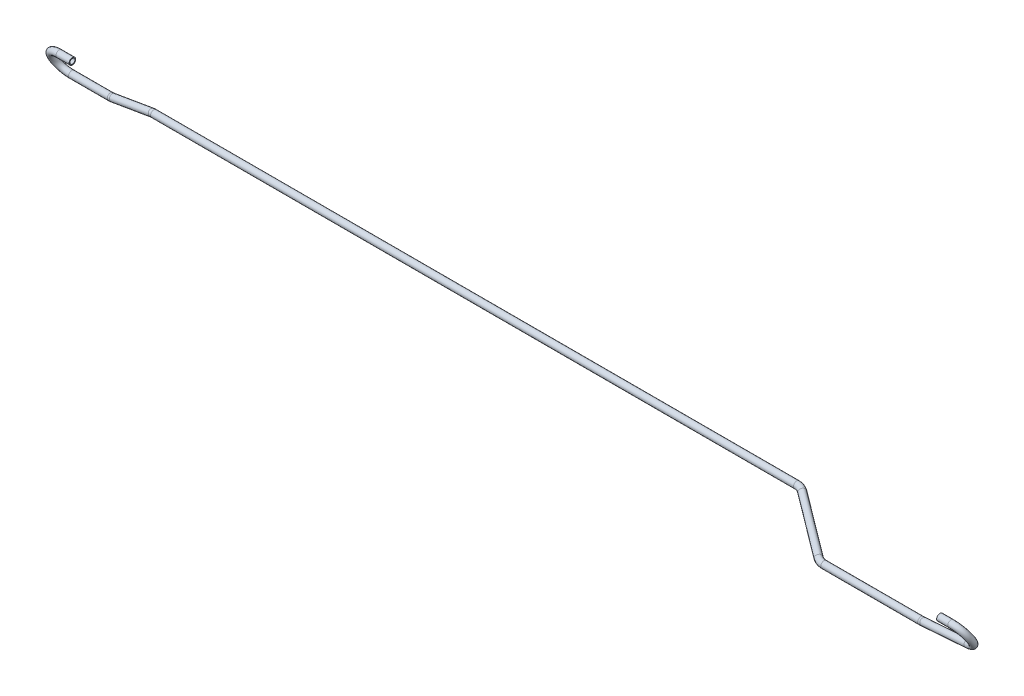
ISO-10303-21;
HEADER;
FILE_DESCRIPTION(('STEP AP214'),'2;1');
FILE_NAME('part.step','',(''),(''),'','','');
FILE_SCHEMA(('AUTOMOTIVE_DESIGN { 1 0 10303 214 1 1 1 1 }'));
ENDSEC;
DATA;
#1=APPLICATION_CONTEXT('core data for automotive mechanical design processes');
#2=APPLICATION_PROTOCOL_DEFINITION('international standard','automotive_design',2000,#1);
#3=PRODUCT_CONTEXT('',#1,'mechanical');
#4=PRODUCT('Part','Part','',(#3));
#5=PRODUCT_RELATED_PRODUCT_CATEGORY('part','',(#4));
#6=PRODUCT_DEFINITION_FORMATION('','',#4);
#7=PRODUCT_DEFINITION_CONTEXT('part definition',#1,'design');
#8=PRODUCT_DEFINITION('design','',#6,#7);
#9=PRODUCT_DEFINITION_SHAPE('','',#8);
#10=(LENGTH_UNIT() NAMED_UNIT(*) SI_UNIT(.MILLI.,.METRE.));
#11=(NAMED_UNIT(*) PLANE_ANGLE_UNIT() SI_UNIT($,.RADIAN.));
#12=(NAMED_UNIT(*) SI_UNIT($,.STERADIAN.) SOLID_ANGLE_UNIT());
#13=UNCERTAINTY_MEASURE_WITH_UNIT(LENGTH_MEASURE(1.E-05),#10,'distance_accuracy_value','');
#14=(GEOMETRIC_REPRESENTATION_CONTEXT(3) GLOBAL_UNCERTAINTY_ASSIGNED_CONTEXT((#13)) GLOBAL_UNIT_ASSIGNED_CONTEXT((#10,
#11,#12)) REPRESENTATION_CONTEXT('',''));
#15=CARTESIAN_POINT('',(0.,0.,0.));
#16=DIRECTION('',(0.,0.,1.));
#17=DIRECTION('',(1.,0.,0.));
#18=AXIS2_PLACEMENT_3D('',#15,#16,#17);
#19=CARTESIAN_POINT('',(-2265.95686527294,-5.47009311471611,-121.5));
#20=DIRECTION('',(1.,0.,0.));
#21=DIRECTION('',(0.,0.,-1.));
#22=AXIS2_PLACEMENT_3D('',#19,#20,#21);
#23=CYLINDRICAL_SURFACE('',#22,8.);
#24=CARTESIAN_POINT('',(-2265.95686527294,-5.47009311471611,-121.5));
#25=DIRECTION('',(1.,0.,0.));
#26=DIRECTION('',(0.,-0.134864319641133,-0.990864075081812));
#27=AXIS2_PLACEMENT_3D('',#24,#25,#26);
#28=CIRCLE('',#27,8.);
#29=CARTESIAN_POINT('',(-2265.95686527294,1.6244410531971,-117.80303030303));
#30=VERTEX_POINT('',#29);
#31=EDGE_CURVE('E47',#30,#30,#28,.T.);
#32=ORIENTED_EDGE('',*,*,#31,.T.);
#33=EDGE_LOOP('',(#32));
#34=FACE_BOUND('',#33,.T.);
#35=CARTESIAN_POINT('',(-2233.95686527294,-5.47009311471611,-121.5));
#36=DIRECTION('',(1.,0.,0.));
#37=DIRECTION('',(0.,-0.134864319641133,-0.990864075081812));
#38=AXIS2_PLACEMENT_3D('',#35,#36,#37);
#39=CIRCLE('',#38,8.);
#40=CARTESIAN_POINT('',(-2233.95686527294,-6.54900767184517,-129.426912600654));
#41=VERTEX_POINT('',#40);
#42=EDGE_CURVE('E10',#41,#41,#39,.T.);
#43=ORIENTED_EDGE('',*,*,#42,.F.);
#44=EDGE_LOOP('',(#43));
#45=FACE_BOUND('',#44,.T.);
#46=ADVANCED_FACE('F37',(#34,#45),#23,.T.);
#47=CARTESIAN_POINT('',(-2265.95686527294,-5.47009311471611,-121.5));
#48=DIRECTION('',(1.,0.,0.));
#49=DIRECTION('',(0.,0.,-1.));
#50=AXIS2_PLACEMENT_3D('',#47,#48,#49);
#51=CYLINDRICAL_SURFACE('',#50,6.);
#52=CARTESIAN_POINT('',(-2265.95686527294,-5.47009311471611,-121.5));
#53=DIRECTION('',(1.,0.,0.));
#54=DIRECTION('',(0.,-0.134864319641133,-0.990864075081812));
#55=AXIS2_PLACEMENT_3D('',#52,#53,#54);
#56=CIRCLE('',#55,6.);
#57=CARTESIAN_POINT('',(-2265.95686527294,-0.149192488781202,-118.727272727273));
#58=VERTEX_POINT('',#57);
#59=EDGE_CURVE('E51',#58,#58,#56,.T.);
#60=ORIENTED_EDGE('',*,*,#59,.F.);
#61=EDGE_LOOP('',(#60));
#62=FACE_BOUND('',#61,.T.);
#63=CARTESIAN_POINT('',(-2233.95686527294,-5.47009311471611,-121.5));
#64=DIRECTION('',(1.,0.,0.));
#65=DIRECTION('',(0.,-0.134864319641133,-0.990864075081812));
#66=AXIS2_PLACEMENT_3D('',#63,#64,#65);
#67=CIRCLE('',#66,6.);
#68=CARTESIAN_POINT('',(-2233.95686527294,-6.27927903256291,-127.445184450491));
#69=VERTEX_POINT('',#68);
#70=EDGE_CURVE('E43',#69,#69,#67,.T.);
#71=ORIENTED_EDGE('',*,*,#70,.T.);
#72=EDGE_LOOP('',(#71));
#73=FACE_BOUND('',#72,.T.);
#74=ADVANCED_FACE('F235',(#62,#73),#51,.F.);
#75=CARTESIAN_POINT('',(-2265.95686527294,-34.7350465573581,-136.75));
#76=DIRECTION('',(0.,0.462121212121212,-0.88681677098915));
#77=DIRECTION('',(0.,0.88681677098915,0.462121212121212));
#78=AXIS2_PLACEMENT_3D('',#75,#76,#77);
#79=TOROIDAL_SURFACE('',#78,33.0000000000001,8.);
#80=CARTESIAN_POINT('',(-2265.95686527294,-64.0000000000001,-152.));
#81=DIRECTION('',(-1.,0.,0.));
#82=DIRECTION('',(0.,0.889407716883756,-0.457114770213811));
#83=AXIS2_PLACEMENT_3D('',#80,#81,#82);
#84=CIRCLE('',#83,8.);
#85=CARTESIAN_POINT('',(-2265.95686527294,-71.0945341679133,-155.69696969697));
#86=VERTEX_POINT('',#85);
#87=EDGE_CURVE('E56',#86,#86,#84,.T.);
#88=CARTESIAN_POINT('',(-2265.95686527294,-34.7350465573581,-136.75));
#89=DIRECTION('',(0.,0.462121212121212,-0.88681677098915));
#90=DIRECTION('',(0.,0.88681677098915,0.462121212121212));
#91=AXIS2_PLACEMENT_3D('',#88,#89,#90);
#92=CIRCLE('',#91,41.0000000000001);
#93=EDGE_CURVE('',#86,#30,#92,.T.);
#94=ORIENTED_EDGE('',*,*,#87,.T.);
#95=ORIENTED_EDGE('',*,*,#31,.F.);
#96=ORIENTED_EDGE('',*,*,#93,.T.);
#97=ORIENTED_EDGE('',*,*,#93,.F.);
#98=EDGE_LOOP('',(#94,#96,#95,#97));
#99=FACE_BOUND('',#98,.T.);
#100=ADVANCED_FACE('F231',(#99),#79,.T.);
#101=CARTESIAN_POINT('',(-2265.95686527294,-34.7350465573581,-136.75));
#102=DIRECTION('',(0.,0.462121212121212,-0.88681677098915));
#103=DIRECTION('',(0.,0.88681677098915,0.462121212121212));
#104=AXIS2_PLACEMENT_3D('',#101,#102,#103);
#105=TOROIDAL_SURFACE('',#104,33.0000000000001,6.);
#106=CARTESIAN_POINT('',(-2265.95686527294,-64.0000000000001,-152.));
#107=DIRECTION('',(-1.,0.,0.));
#108=DIRECTION('',(0.,0.889407716883756,-0.457114770213811));
#109=AXIS2_PLACEMENT_3D('',#106,#107,#108);
#110=CIRCLE('',#109,6.);
#111=CARTESIAN_POINT('',(-2265.95686527294,-69.320900625935,-154.772727272727));
#112=VERTEX_POINT('',#111);
#113=EDGE_CURVE('E59',#112,#112,#110,.T.);
#114=CARTESIAN_POINT('',(-2265.95686527294,-34.7350465573581,-136.75));
#115=DIRECTION('',(0.,0.462121212121212,-0.88681677098915));
#116=DIRECTION('',(0.,0.88681677098915,0.462121212121212));
#117=AXIS2_PLACEMENT_3D('',#114,#115,#116);
#118=CIRCLE('',#117,39.0000000000001);
#119=EDGE_CURVE('',#112,#58,#118,.T.);
#120=ORIENTED_EDGE('',*,*,#113,.F.);
#121=ORIENTED_EDGE('',*,*,#59,.T.);
#122=ORIENTED_EDGE('',*,*,#119,.T.);
#123=ORIENTED_EDGE('',*,*,#119,.F.);
#124=EDGE_LOOP('',(#120,#122,#121,#123));
#125=FACE_BOUND('',#124,.T.);
#126=ADVANCED_FACE('F228',(#125),#105,.F.);
#127=CARTESIAN_POINT('',(-2171.74188680867,-64.0000000000002,-152.));
#128=DIRECTION('',(-1.,0.,0.));
#129=DIRECTION('',(0.,-1.,0.));
#130=AXIS2_PLACEMENT_3D('',#127,#128,#129);
#131=CYLINDRICAL_SURFACE('',#130,8.);
#132=CARTESIAN_POINT('',(-2171.74188680867,-64.0000000000002,-152.));
#133=DIRECTION('',(-1.,0.,0.));
#134=DIRECTION('',(0.,0.889407716883756,-0.457114770213811));
#135=AXIS2_PLACEMENT_3D('',#132,#133,#134);
#136=CIRCLE('',#135,8.);
#137=CARTESIAN_POINT('',(-2171.74188680867,-72.0000000000001,-152.));
#138=VERTEX_POINT('',#137);
#139=EDGE_CURVE('E62',#138,#138,#136,.T.);
#140=ORIENTED_EDGE('',*,*,#139,.T.);
#141=EDGE_LOOP('',(#140));
#142=FACE_BOUND('',#141,.T.);
#143=ORIENTED_EDGE('',*,*,#87,.F.);
#144=EDGE_LOOP('',(#143));
#145=FACE_BOUND('',#144,.T.);
#146=ADVANCED_FACE('F224',(#142,#145),#131,.T.);
#147=CARTESIAN_POINT('',(-2171.74188680867,-64.0000000000002,-152.));
#148=DIRECTION('',(-1.,0.,0.));
#149=DIRECTION('',(0.,-1.,0.));
#150=AXIS2_PLACEMENT_3D('',#147,#148,#149);
#151=CYLINDRICAL_SURFACE('',#150,6.);
#152=CARTESIAN_POINT('',(-2171.74188680867,-64.0000000000002,-152.));
#153=DIRECTION('',(-1.,0.,0.));
#154=DIRECTION('',(0.,0.889407716883756,-0.457114770213811));
#155=AXIS2_PLACEMENT_3D('',#152,#153,#154);
#156=CIRCLE('',#155,6.);
#157=CARTESIAN_POINT('',(-2171.74188680867,-70.0000000000001,-152.));
#158=VERTEX_POINT('',#157);
#159=EDGE_CURVE('E65',#158,#158,#156,.T.);
#160=ORIENTED_EDGE('',*,*,#159,.F.);
#161=EDGE_LOOP('',(#160));
#162=FACE_BOUND('',#161,.T.);
#163=ORIENTED_EDGE('',*,*,#113,.T.);
#164=EDGE_LOOP('',(#163));
#165=FACE_BOUND('',#164,.T.);
#166=ADVANCED_FACE('F221',(#162,#165),#151,.F.);
#167=CARTESIAN_POINT('',(-2171.74188680867,-31.,-152.));
#168=DIRECTION('',(0.,0.,-1.));
#169=DIRECTION('',(0.,1.,0.));
#170=AXIS2_PLACEMENT_3D('',#167,#168,#169);
#171=TOROIDAL_SURFACE('',#170,33.0000000000001,8.);
#172=CARTESIAN_POINT('',(-2166.21123550885,-63.533242940104,-152.));
#173=DIRECTION('',(-0.985855846669819,-0.167595493933862,0.));
#174=DIRECTION('',(-0.149060725619722,0.876827797763105,-0.457114770213811));
#175=AXIS2_PLACEMENT_3D('',#172,#173,#174);
#176=CIRCLE('',#175,8.);
#177=CARTESIAN_POINT('',(-2164.87047155738,-71.4200897134626,-152.));
#178=VERTEX_POINT('',#177);
#179=EDGE_CURVE('E68',#178,#178,#176,.T.);
#180=CARTESIAN_POINT('',(-2171.74188680867,-31.,-152.));
#181=DIRECTION('',(0.,0.,-1.));
#182=DIRECTION('',(0.,1.,0.));
#183=AXIS2_PLACEMENT_3D('',#180,#181,#182);
#184=CIRCLE('',#183,41.0000000000001);
#185=EDGE_CURVE('',#178,#138,#184,.T.);
#186=ORIENTED_EDGE('',*,*,#179,.T.);
#187=ORIENTED_EDGE('',*,*,#139,.F.);
#188=ORIENTED_EDGE('',*,*,#185,.T.);
#189=ORIENTED_EDGE('',*,*,#185,.F.);
#190=EDGE_LOOP('',(#186,#188,#187,#189));
#191=FACE_BOUND('',#190,.T.);
#192=ADVANCED_FACE('F217',(#191),#171,.T.);
#193=CARTESIAN_POINT('',(-2171.74188680867,-31.,-152.));
#194=DIRECTION('',(0.,0.,-1.));
#195=DIRECTION('',(0.,1.,0.));
#196=AXIS2_PLACEMENT_3D('',#193,#194,#195);
#197=TOROIDAL_SURFACE('',#196,33.0000000000001,6.);
#198=CARTESIAN_POINT('',(-2166.21123550885,-63.533242940104,-152.));
#199=DIRECTION('',(-0.985855846669819,-0.167595493933862,0.));
#200=DIRECTION('',(-0.149060725619722,0.876827797763105,-0.457114770213811));
#201=AXIS2_PLACEMENT_3D('',#198,#199,#200);
#202=CIRCLE('',#201,6.);
#203=CARTESIAN_POINT('',(-2165.20566254525,-69.4483780201229,-152.));
#204=VERTEX_POINT('',#203);
#205=EDGE_CURVE('E71',#204,#204,#202,.T.);
#206=CARTESIAN_POINT('',(-2171.74188680867,-31.,-152.));
#207=DIRECTION('',(0.,0.,-1.));
#208=DIRECTION('',(0.,1.,0.));
#209=AXIS2_PLACEMENT_3D('',#206,#207,#208);
#210=CIRCLE('',#209,39.0000000000001);
#211=EDGE_CURVE('',#204,#158,#210,.T.);
#212=ORIENTED_EDGE('',*,*,#205,.F.);
#213=ORIENTED_EDGE('',*,*,#159,.T.);
#214=ORIENTED_EDGE('',*,*,#211,.T.);
#215=ORIENTED_EDGE('',*,*,#211,.F.);
#216=EDGE_LOOP('',(#212,#214,#213,#215));
#217=FACE_BOUND('',#216,.T.);
#218=ADVANCED_FACE('F214',(#217),#197,.F.);
#219=CARTESIAN_POINT('',(-2071.70249503704,-47.4667570598961,-152.));
#220=DIRECTION('',(-0.985855846669818,-0.167595493933869,0.));
#221=DIRECTION('',(0.167595493933869,-0.985855846669817,0.));
#222=AXIS2_PLACEMENT_3D('',#219,#220,#221);
#223=CYLINDRICAL_SURFACE('',#222,8.);
#224=CARTESIAN_POINT('',(-2071.70249503704,-47.4667570598961,-152.));
#225=DIRECTION('',(-0.985855846669819,-0.167595493933862,0.));
#226=DIRECTION('',(-0.149060725619722,0.876827797763105,-0.457114770213811));
#227=AXIS2_PLACEMENT_3D('',#224,#225,#226);
#228=CIRCLE('',#227,8.);
#229=CARTESIAN_POINT('',(-2073.04325898851,-39.5799102865375,-152.));
#230=VERTEX_POINT('',#229);
#231=EDGE_CURVE('E74',#230,#230,#228,.T.);
#232=ORIENTED_EDGE('',*,*,#231,.T.);
#233=EDGE_LOOP('',(#232));
#234=FACE_BOUND('',#233,.T.);
#235=ORIENTED_EDGE('',*,*,#179,.F.);
#236=EDGE_LOOP('',(#235));
#237=FACE_BOUND('',#236,.T.);
#238=ADVANCED_FACE('F210',(#234,#237),#223,.T.);
#239=CARTESIAN_POINT('',(-2071.70249503704,-47.4667570598961,-152.));
#240=DIRECTION('',(-0.985855846669818,-0.167595493933869,0.));
#241=DIRECTION('',(0.167595493933869,-0.985855846669817,0.));
#242=AXIS2_PLACEMENT_3D('',#239,#240,#241);
#243=CYLINDRICAL_SURFACE('',#242,6.);
#244=CARTESIAN_POINT('',(-2071.70249503704,-47.4667570598961,-152.));
#245=DIRECTION('',(-0.985855846669819,-0.167595493933862,0.));
#246=DIRECTION('',(-0.149060725619722,0.876827797763105,-0.457114770213811));
#247=AXIS2_PLACEMENT_3D('',#244,#245,#246);
#248=CIRCLE('',#247,6.);
#249=CARTESIAN_POINT('',(-2072.70806800064,-41.5516219798771,-152.));
#250=VERTEX_POINT('',#249);
#251=EDGE_CURVE('E77',#250,#250,#248,.T.);
#252=ORIENTED_EDGE('',*,*,#251,.F.);
#253=EDGE_LOOP('',(#252));
#254=FACE_BOUND('',#253,.T.);
#255=ORIENTED_EDGE('',*,*,#205,.T.);
#256=EDGE_LOOP('',(#255));
#257=FACE_BOUND('',#256,.T.);
#258=ADVANCED_FACE('F207',(#254,#257),#243,.F.);
#259=CARTESIAN_POINT('',(-2066.17184373722,-80.,-152.));
#260=DIRECTION('',(0.,0.,1.));
#261=DIRECTION('',(0.,-1.,0.));
#262=AXIS2_PLACEMENT_3D('',#259,#260,#261);
#263=TOROIDAL_SURFACE('',#262,33.,8.);
#264=CARTESIAN_POINT('',(-2066.17184373722,-47.,-152.));
#265=DIRECTION('',(-1.,0.,0.));
#266=DIRECTION('',(0.,0.889407716883756,-0.457114770213811));
#267=AXIS2_PLACEMENT_3D('',#264,#265,#266);
#268=CIRCLE('',#267,8.);
#269=CARTESIAN_POINT('',(-2066.17184373722,-39.,-152.));
#270=VERTEX_POINT('',#269);
#271=EDGE_CURVE('E80',#270,#270,#268,.T.);
#272=CARTESIAN_POINT('',(-2066.17184373722,-80.,-152.));
#273=DIRECTION('',(0.,0.,1.));
#274=DIRECTION('',(0.,-1.,0.));
#275=AXIS2_PLACEMENT_3D('',#272,#273,#274);
#276=CIRCLE('',#275,41.);
#277=EDGE_CURVE('',#270,#230,#276,.T.);
#278=ORIENTED_EDGE('',*,*,#271,.T.);
#279=ORIENTED_EDGE('',*,*,#231,.F.);
#280=ORIENTED_EDGE('',*,*,#277,.T.);
#281=ORIENTED_EDGE('',*,*,#277,.F.);
#282=EDGE_LOOP('',(#278,#280,#279,#281));
#283=FACE_BOUND('',#282,.T.);
#284=ADVANCED_FACE('F203',(#283),#263,.T.);
#285=CARTESIAN_POINT('',(-2066.17184373722,-80.,-152.));
#286=DIRECTION('',(0.,0.,1.));
#287=DIRECTION('',(0.,-1.,0.));
#288=AXIS2_PLACEMENT_3D('',#285,#286,#287);
#289=TOROIDAL_SURFACE('',#288,33.,6.);
#290=CARTESIAN_POINT('',(-2066.17184373722,-47.,-152.));
#291=DIRECTION('',(-1.,0.,0.));
#292=DIRECTION('',(0.,0.889407716883756,-0.457114770213811));
#293=AXIS2_PLACEMENT_3D('',#290,#291,#292);
#294=CIRCLE('',#293,6.);
#295=CARTESIAN_POINT('',(-2066.17184373722,-41.,-152.));
#296=VERTEX_POINT('',#295);
#297=EDGE_CURVE('E83',#296,#296,#294,.T.);
#298=CARTESIAN_POINT('',(-2066.17184373722,-80.,-152.));
#299=DIRECTION('',(0.,0.,1.));
#300=DIRECTION('',(0.,-1.,0.));
#301=AXIS2_PLACEMENT_3D('',#298,#299,#300);
#302=CIRCLE('',#301,39.);
#303=EDGE_CURVE('',#296,#250,#302,.T.);
#304=ORIENTED_EDGE('',*,*,#297,.F.);
#305=ORIENTED_EDGE('',*,*,#251,.T.);
#306=ORIENTED_EDGE('',*,*,#303,.T.);
#307=ORIENTED_EDGE('',*,*,#303,.F.);
#308=EDGE_LOOP('',(#304,#306,#305,#307));
#309=FACE_BOUND('',#308,.T.);
#310=ADVANCED_FACE('F200',(#309),#289,.F.);
#311=CARTESIAN_POINT('',(-500.739873178463,-47.,-152.));
#312=DIRECTION('',(-1.,0.,0.));
#313=DIRECTION('',(0.,0.,1.));
#314=AXIS2_PLACEMENT_3D('',#311,#312,#313);
#315=CYLINDRICAL_SURFACE('',#314,8.);
#316=CARTESIAN_POINT('',(-500.739873178463,-47.,-152.));
#317=DIRECTION('',(-1.,0.,0.));
#318=DIRECTION('',(0.,0.889407716883756,-0.457114770213811));
#319=AXIS2_PLACEMENT_3D('',#316,#317,#318);
#320=CIRCLE('',#319,8.);
#321=CARTESIAN_POINT('',(-500.739873178463,-44.802230976821,-159.692191581126));
#322=VERTEX_POINT('',#321);
#323=EDGE_CURVE('E86',#322,#322,#320,.T.);
#324=ORIENTED_EDGE('',*,*,#323,.T.);
#325=EDGE_LOOP('',(#324));
#326=FACE_BOUND('',#325,.T.);
#327=ORIENTED_EDGE('',*,*,#271,.F.);
#328=EDGE_LOOP('',(#327));
#329=FACE_BOUND('',#328,.T.);
#330=ADVANCED_FACE('F196',(#326,#329),#315,.T.);
#331=CARTESIAN_POINT('',(-500.739873178463,-47.,-152.));
#332=DIRECTION('',(-1.,0.,0.));
#333=DIRECTION('',(0.,0.,1.));
#334=AXIS2_PLACEMENT_3D('',#331,#332,#333);
#335=CYLINDRICAL_SURFACE('',#334,6.);
#336=CARTESIAN_POINT('',(-500.739873178463,-47.,-152.));
#337=DIRECTION('',(-1.,0.,0.));
#338=DIRECTION('',(0.,0.889407716883756,-0.457114770213811));
#339=AXIS2_PLACEMENT_3D('',#336,#337,#338);
#340=CIRCLE('',#339,6.);
#341=CARTESIAN_POINT('',(-500.739873178463,-45.3516732326158,-157.769143685845));
#342=VERTEX_POINT('',#341);
#343=EDGE_CURVE('E89',#342,#342,#340,.T.);
#344=ORIENTED_EDGE('',*,*,#343,.F.);
#345=EDGE_LOOP('',(#344));
#346=FACE_BOUND('',#345,.T.);
#347=ORIENTED_EDGE('',*,*,#297,.T.);
#348=EDGE_LOOP('',(#347));
#349=FACE_BOUND('',#348,.T.);
#350=ADVANCED_FACE('F193',(#346,#349),#335,.F.);
#351=CARTESIAN_POINT('',(-500.739873178463,-56.0657972206135,-120.269709727853));
#352=DIRECTION('',(0.,0.961523947640823,0.274721127897378));
#353=DIRECTION('',(0.,-0.274721127897378,0.961523947640823));
#354=AXIS2_PLACEMENT_3D('',#351,#352,#353);
#355=TOROIDAL_SURFACE('',#354,32.9999999999999,8.);
#356=CARTESIAN_POINT('',(-481.317327152835,-48.7365345694331,-145.922129006984));
#357=DIRECTION('',(-0.808452083454443,0.161690416690889,-0.565916458418111));
#358=DIRECTION('',(0.402497476201035,0.853421148459082,-0.331161780727455));
#359=AXIS2_PLACEMENT_3D('',#356,#357,#358);
#360=CIRCLE('',#359,8.);
#361=CARTESIAN_POINT('',(-476.608831146622,-46.9597436236923,-152.140897317077));
#362=VERTEX_POINT('',#361);
#363=EDGE_CURVE('E92',#362,#362,#360,.T.);
#364=CARTESIAN_POINT('',(-500.739873178463,-56.0657972206135,-120.269709727853));
#365=DIRECTION('',(0.,0.961523947640823,0.274721127897378));
#366=DIRECTION('',(0.,-0.274721127897378,0.961523947640823));
#367=AXIS2_PLACEMENT_3D('',#364,#365,#366);
#368=CIRCLE('',#367,40.9999999999999);
#369=EDGE_CURVE('',#362,#322,#368,.T.);
#370=ORIENTED_EDGE('',*,*,#363,.T.);
#371=ORIENTED_EDGE('',*,*,#323,.F.);
#372=ORIENTED_EDGE('',*,*,#369,.T.);
#373=ORIENTED_EDGE('',*,*,#369,.F.);
#374=EDGE_LOOP('',(#370,#372,#371,#373));
#375=FACE_BOUND('',#374,.T.);
#376=ADVANCED_FACE('F189',(#375),#355,.T.);
#377=CARTESIAN_POINT('',(-500.739873178463,-56.0657972206135,-120.269709727853));
#378=DIRECTION('',(0.,0.961523947640823,0.274721127897378));
#379=DIRECTION('',(0.,-0.274721127897378,0.961523947640823));
#380=AXIS2_PLACEMENT_3D('',#377,#378,#379);
#381=TOROIDAL_SURFACE('',#380,32.9999999999999,6.);
#382=CARTESIAN_POINT('',(-481.317327152835,-48.7365345694331,-145.922129006984));
#383=DIRECTION('',(-0.808452083454443,0.161690416690889,-0.565916458418111));
#384=DIRECTION('',(0.402497476201035,0.853421148459082,-0.331161780727455));
#385=AXIS2_PLACEMENT_3D('',#382,#383,#384);
#386=CIRCLE('',#385,6.);
#387=CARTESIAN_POINT('',(-477.785955148175,-47.4039413601275,-150.586205239554));
#388=VERTEX_POINT('',#387);
#389=EDGE_CURVE('E95',#388,#388,#386,.T.);
#390=CARTESIAN_POINT('',(-500.739873178463,-56.0657972206135,-120.269709727853));
#391=DIRECTION('',(0.,0.961523947640823,0.274721127897378));
#392=DIRECTION('',(0.,-0.274721127897378,0.961523947640823));
#393=AXIS2_PLACEMENT_3D('',#390,#391,#392);
#394=CIRCLE('',#393,38.9999999999999);
#395=EDGE_CURVE('',#388,#342,#394,.T.);
#396=ORIENTED_EDGE('',*,*,#389,.F.);
#397=ORIENTED_EDGE('',*,*,#343,.T.);
#398=ORIENTED_EDGE('',*,*,#395,.T.);
#399=ORIENTED_EDGE('',*,*,#395,.F.);
#400=EDGE_LOOP('',(#396,#398,#397,#399));
#401=FACE_BOUND('',#400,.T.);
#402=ADVANCED_FACE('F186',(#401),#381,.F.);
#403=CARTESIAN_POINT('',(-348.682672847165,-75.263465430567,-53.0778709930156));
#404=DIRECTION('',(-0.808452083454443,0.161690416690889,-0.56591645841811));
#405=DIRECTION('',(-0.573462344363328,0.,0.819231920519041));
#406=AXIS2_PLACEMENT_3D('',#403,#404,#405);
#407=CYLINDRICAL_SURFACE('',#406,8.);
#408=CARTESIAN_POINT('',(-348.682672847165,-75.263465430567,-53.0778709930156));
#409=DIRECTION('',(-0.808452083454443,0.161690416690889,-0.565916458418111));
#410=DIRECTION('',(0.402497476201035,0.853421148459082,-0.331161780727455));
#411=AXIS2_PLACEMENT_3D('',#408,#409,#410);
#412=CIRCLE('',#411,8.);
#413=CARTESIAN_POINT('',(-353.391168853378,-77.0402563763078,-46.8591026829231));
#414=VERTEX_POINT('',#413);
#415=EDGE_CURVE('E98',#414,#414,#412,.T.);
#416=ORIENTED_EDGE('',*,*,#415,.T.);
#417=EDGE_LOOP('',(#416));
#418=FACE_BOUND('',#417,.T.);
#419=ORIENTED_EDGE('',*,*,#363,.F.);
#420=EDGE_LOOP('',(#419));
#421=FACE_BOUND('',#420,.T.);
#422=ADVANCED_FACE('F182',(#418,#421),#407,.T.);
#423=CARTESIAN_POINT('',(-348.682672847165,-75.263465430567,-53.0778709930156));
#424=DIRECTION('',(-0.808452083454443,0.161690416690889,-0.56591645841811));
#425=DIRECTION('',(-0.573462344363328,0.,0.819231920519041));
#426=AXIS2_PLACEMENT_3D('',#423,#424,#425);
#427=CYLINDRICAL_SURFACE('',#426,6.);
#428=CARTESIAN_POINT('',(-348.682672847165,-75.263465430567,-53.0778709930156));
#429=DIRECTION('',(-0.808452083454443,0.161690416690889,-0.565916458418111));
#430=DIRECTION('',(0.402497476201035,0.853421148459082,-0.331161780727455));
#431=AXIS2_PLACEMENT_3D('',#428,#429,#430);
#432=CIRCLE('',#431,6.);
#433=CARTESIAN_POINT('',(-352.214044851825,-76.5960586398726,-48.4137947604462));
#434=VERTEX_POINT('',#433);
#435=EDGE_CURVE('E101',#434,#434,#432,.T.);
#436=ORIENTED_EDGE('',*,*,#435,.F.);
#437=EDGE_LOOP('',(#436));
#438=FACE_BOUND('',#437,.T.);
#439=ORIENTED_EDGE('',*,*,#389,.T.);
#440=EDGE_LOOP('',(#439));
#441=FACE_BOUND('',#440,.T.);
#442=ADVANCED_FACE('F179',(#438,#441),#427,.F.);
#443=CARTESIAN_POINT('',(-329.260126821537,-67.9342027793866,-78.7302902721472));
#444=DIRECTION('',(0.,-0.961523947640823,-0.274721127897378));
#445=DIRECTION('',(0.,0.274721127897378,-0.961523947640823));
#446=AXIS2_PLACEMENT_3D('',#443,#444,#445);
#447=TOROIDAL_SURFACE('',#446,33.,8.);
#448=CARTESIAN_POINT('',(-329.260126821537,-77.,-47.));
#449=DIRECTION('',(-1.,0.,0.));
#450=DIRECTION('',(0.,0.889407716883756,-0.457114770213811));
#451=AXIS2_PLACEMENT_3D('',#448,#449,#450);
#452=CIRCLE('',#451,8.);
#453=CARTESIAN_POINT('',(-329.260126821537,-79.1977690231791,-39.3078084188734));
#454=VERTEX_POINT('',#453);
#455=EDGE_CURVE('E104',#454,#454,#452,.T.);
#456=CARTESIAN_POINT('',(-329.260126821537,-67.9342027793866,-78.7302902721472));
#457=DIRECTION('',(0.,-0.961523947640823,-0.274721127897378));
#458=DIRECTION('',(0.,0.274721127897378,-0.961523947640823));
#459=AXIS2_PLACEMENT_3D('',#456,#457,#458);
#460=CIRCLE('',#459,41.);
#461=EDGE_CURVE('',#454,#414,#460,.T.);
#462=ORIENTED_EDGE('',*,*,#455,.T.);
#463=ORIENTED_EDGE('',*,*,#415,.F.);
#464=ORIENTED_EDGE('',*,*,#461,.T.);
#465=ORIENTED_EDGE('',*,*,#461,.F.);
#466=EDGE_LOOP('',(#462,#464,#463,#465));
#467=FACE_BOUND('',#466,.T.);
#468=ADVANCED_FACE('F175',(#467),#447,.T.);
#469=CARTESIAN_POINT('',(-329.260126821537,-67.9342027793866,-78.7302902721472));
#470=DIRECTION('',(0.,-0.961523947640823,-0.274721127897378));
#471=DIRECTION('',(0.,0.274721127897378,-0.961523947640823));
#472=AXIS2_PLACEMENT_3D('',#469,#470,#471);
#473=TOROIDAL_SURFACE('',#472,33.,6.);
#474=CARTESIAN_POINT('',(-329.260126821537,-77.,-47.));
#475=DIRECTION('',(-1.,0.,0.));
#476=DIRECTION('',(0.,0.889407716883756,-0.457114770213811));
#477=AXIS2_PLACEMENT_3D('',#474,#475,#476);
#478=CIRCLE('',#477,6.);
#479=CARTESIAN_POINT('',(-329.260126821537,-78.6483267673843,-41.230856314155));
#480=VERTEX_POINT('',#479);
#481=EDGE_CURVE('E107',#480,#480,#478,.T.);
#482=CARTESIAN_POINT('',(-329.260126821537,-67.9342027793866,-78.7302902721472));
#483=DIRECTION('',(0.,-0.961523947640823,-0.274721127897378));
#484=DIRECTION('',(0.,0.274721127897378,-0.961523947640823));
#485=AXIS2_PLACEMENT_3D('',#482,#483,#484);
#486=CIRCLE('',#485,39.);
#487=EDGE_CURVE('',#480,#434,#486,.T.);
#488=ORIENTED_EDGE('',*,*,#481,.F.);
#489=ORIENTED_EDGE('',*,*,#435,.T.);
#490=ORIENTED_EDGE('',*,*,#487,.T.);
#491=ORIENTED_EDGE('',*,*,#487,.F.);
#492=EDGE_LOOP('',(#488,#490,#489,#491));
#493=FACE_BOUND('',#492,.T.);
#494=ADVANCED_FACE('F172',(#493),#473,.F.);
#495=CARTESIAN_POINT('',(-93.2880517598291,-77.,-47.));
#496=DIRECTION('',(-1.,0.,0.));
#497=DIRECTION('',(0.,0.,1.));
#498=AXIS2_PLACEMENT_3D('',#495,#496,#497);
#499=CYLINDRICAL_SURFACE('',#498,8.);
#500=CARTESIAN_POINT('',(-93.2880517598291,-77.,-47.));
#501=DIRECTION('',(-1.,0.,0.));
#502=DIRECTION('',(0.,0.889407716883756,-0.457114770213811));
#503=AXIS2_PLACEMENT_3D('',#500,#501,#502);
#504=CIRCLE('',#503,8.);
#505=CARTESIAN_POINT('',(-93.2880517598291,-83.8284458441758,-51.168012398393));
#506=VERTEX_POINT('',#505);
#507=EDGE_CURVE('E110',#506,#506,#504,.T.);
#508=ORIENTED_EDGE('',*,*,#507,.T.);
#509=EDGE_LOOP('',(#508));
#510=FACE_BOUND('',#509,.T.);
#511=ORIENTED_EDGE('',*,*,#455,.F.);
#512=EDGE_LOOP('',(#511));
#513=FACE_BOUND('',#512,.T.);
#514=ADVANCED_FACE('F168',(#510,#513),#499,.T.);
#515=CARTESIAN_POINT('',(-93.2880517598291,-77.,-47.));
#516=DIRECTION('',(-1.,0.,0.));
#517=DIRECTION('',(0.,0.,1.));
#518=AXIS2_PLACEMENT_3D('',#515,#516,#517);
#519=CYLINDRICAL_SURFACE('',#518,6.);
#520=CARTESIAN_POINT('',(-93.2880517598291,-77.,-47.));
#521=DIRECTION('',(-1.,0.,0.));
#522=DIRECTION('',(0.,0.889407716883756,-0.457114770213811));
#523=AXIS2_PLACEMENT_3D('',#520,#521,#522);
#524=CIRCLE('',#523,6.);
#525=CARTESIAN_POINT('',(-93.2880517598291,-82.1213343831319,-50.1260092987948));
#526=VERTEX_POINT('',#525);
#527=EDGE_CURVE('E113',#526,#526,#524,.T.);
#528=ORIENTED_EDGE('',*,*,#527,.F.);
#529=EDGE_LOOP('',(#528));
#530=FACE_BOUND('',#529,.T.);
#531=ORIENTED_EDGE('',*,*,#481,.T.);
#532=EDGE_LOOP('',(#531));
#533=FACE_BOUND('',#532,.T.);
#534=ADVANCED_FACE('F165',(#530,#533),#519,.F.);
#535=CARTESIAN_POINT('',(-93.2880517598291,-48.8326608927748,-29.8069488566287));
#536=DIRECTION('',(0.,0.52100154979913,-0.853555730521976));
#537=DIRECTION('',(0.,0.853555730521976,0.52100154979913));
#538=AXIS2_PLACEMENT_3D('',#535,#536,#537);
#539=TOROIDAL_SURFACE('',#538,33.,8.);
#540=CARTESIAN_POINT('',(-86.7765921715822,-76.4462229702306,-46.6619802545563));
#541=DIRECTION('',(-0.980339746411211,-0.168421019563951,-0.102802440513061));
#542=DIRECTION('',(-0.102802440513061,0.880664726254876,-0.462451400857413));
#543=AXIS2_PLACEMENT_3D('',#540,#541,#542);
#544=CIRCLE('',#543,8.);
#545=CARTESIAN_POINT('',(-85.1980565138254,-83.1404198374926,-50.7480484722357));
#546=VERTEX_POINT('',#545);
#547=EDGE_CURVE('E116',#546,#546,#544,.T.);
#548=CARTESIAN_POINT('',(-93.2880517598291,-48.8326608927748,-29.8069488566287));
#549=DIRECTION('',(0.,0.52100154979913,-0.853555730521976));
#550=DIRECTION('',(0.,0.853555730521976,0.52100154979913));
#551=AXIS2_PLACEMENT_3D('',#548,#549,#550);
#552=CIRCLE('',#551,41.);
#553=EDGE_CURVE('',#546,#506,#552,.T.);
#554=ORIENTED_EDGE('',*,*,#547,.T.);
#555=ORIENTED_EDGE('',*,*,#507,.F.);
#556=ORIENTED_EDGE('',*,*,#553,.T.);
#557=ORIENTED_EDGE('',*,*,#553,.F.);
#558=EDGE_LOOP('',(#554,#556,#555,#557));
#559=FACE_BOUND('',#558,.T.);
#560=ADVANCED_FACE('F161',(#559),#539,.T.);
#561=CARTESIAN_POINT('',(-93.2880517598291,-48.8326608927748,-29.8069488566287));
#562=DIRECTION('',(0.,0.52100154979913,-0.853555730521976));
#563=DIRECTION('',(0.,0.853555730521976,0.52100154979913));
#564=AXIS2_PLACEMENT_3D('',#561,#562,#563);
#565=TOROIDAL_SURFACE('',#564,33.,6.);
#566=CARTESIAN_POINT('',(-86.7765921715822,-76.4462229702306,-46.6619802545563));
#567=DIRECTION('',(-0.980339746411211,-0.168421019563951,-0.102802440513061));
#568=DIRECTION('',(-0.102802440513061,0.880664726254876,-0.462451400857413));
#569=AXIS2_PLACEMENT_3D('',#566,#567,#568);
#570=CIRCLE('',#569,6.);
#571=CARTESIAN_POINT('',(-85.5926904282646,-81.4668706206771,-49.7265314178159));
#572=VERTEX_POINT('',#571);
#573=EDGE_CURVE('E119',#572,#572,#570,.T.);
#574=CARTESIAN_POINT('',(-93.2880517598291,-48.8326608927748,-29.8069488566287));
#575=DIRECTION('',(0.,0.52100154979913,-0.853555730521976));
#576=DIRECTION('',(0.,0.853555730521976,0.52100154979913));
#577=AXIS2_PLACEMENT_3D('',#574,#575,#576);
#578=CIRCLE('',#577,39.);
#579=EDGE_CURVE('',#572,#526,#578,.T.);
#580=ORIENTED_EDGE('',*,*,#573,.F.);
#581=ORIENTED_EDGE('',*,*,#527,.T.);
#582=ORIENTED_EDGE('',*,*,#579,.T.);
#583=ORIENTED_EDGE('',*,*,#579,.F.);
#584=EDGE_LOOP('',(#580,#582,#581,#583));
#585=FACE_BOUND('',#584,.T.);
#586=ADVANCED_FACE('F158',(#585),#565,.F.);
#587=CARTESIAN_POINT('',(33.5114595882469,-55.780901184681,-34.0480825412988));
#588=DIRECTION('',(-0.980339746411211,-0.168421019563951,-0.10280244051306));
#589=DIRECTION('',(0.169318101811754,-0.985561454399909,0.));
#590=AXIS2_PLACEMENT_3D('',#587,#588,#589);
#591=CYLINDRICAL_SURFACE('',#590,8.);
#592=CARTESIAN_POINT('',(33.5114595882469,-55.780901184681,-34.0480825412988));
#593=DIRECTION('',(-0.980339746411211,-0.168421019563951,-0.102802440513061));
#594=DIRECTION('',(-0.102802440513061,0.880664726254876,-0.462451400857413));
#595=AXIS2_PLACEMENT_3D('',#592,#593,#594);
#596=CIRCLE('',#595,8.);
#597=CARTESIAN_POINT('',(35.0899952460037,-62.475098051943,-38.1341507589782));
#598=VERTEX_POINT('',#597);
#599=EDGE_CURVE('E122',#598,#598,#596,.T.);
#600=ORIENTED_EDGE('',*,*,#599,.T.);
#601=EDGE_LOOP('',(#600));
#602=FACE_BOUND('',#601,.T.);
#603=ORIENTED_EDGE('',*,*,#547,.F.);
#604=EDGE_LOOP('',(#603));
#605=FACE_BOUND('',#604,.T.);
#606=ADVANCED_FACE('F154',(#602,#605),#591,.T.);
#607=CARTESIAN_POINT('',(33.5114595882469,-55.780901184681,-34.0480825412988));
#608=DIRECTION('',(-0.980339746411211,-0.168421019563951,-0.10280244051306));
#609=DIRECTION('',(0.169318101811754,-0.985561454399909,0.));
#610=AXIS2_PLACEMENT_3D('',#607,#608,#609);
#611=CYLINDRICAL_SURFACE('',#610,6.);
#612=CARTESIAN_POINT('',(33.5114595882469,-55.780901184681,-34.0480825412988));
#613=DIRECTION('',(-0.980339746411211,-0.168421019563951,-0.102802440513061));
#614=DIRECTION('',(-0.102802440513061,0.880664726254876,-0.462451400857413));
#615=AXIS2_PLACEMENT_3D('',#612,#613,#614);
#616=CIRCLE('',#615,6.);
#617=CARTESIAN_POINT('',(34.6953613315645,-60.8015488351275,-37.1126337045584));
#618=VERTEX_POINT('',#617);
#619=EDGE_CURVE('E125',#618,#618,#616,.T.);
#620=ORIENTED_EDGE('',*,*,#619,.F.);
#621=EDGE_LOOP('',(#620));
#622=FACE_BOUND('',#621,.T.);
#623=ORIENTED_EDGE('',*,*,#573,.T.);
#624=EDGE_LOOP('',(#623));
#625=FACE_BOUND('',#624,.T.);
#626=ADVANCED_FACE('F151',(#622,#625),#611,.F.);
#627=CARTESIAN_POINT('',(27.,-28.1673391072252,-17.1930511433713));
#628=DIRECTION('',(0.,0.521001549799129,-0.853555730521977));
#629=DIRECTION('',(0.,0.853555730521977,0.521001549799129));
#630=AXIS2_PLACEMENT_3D('',#627,#628,#629);
#631=TOROIDAL_SURFACE('',#630,33.,8.);
#632=CARTESIAN_POINT('',(27.,0.,0.));
#633=DIRECTION('',(1.,0.,0.));
#634=DIRECTION('',(0.,0.,-1.));
#635=AXIS2_PLACEMENT_3D('',#632,#633,#634);
#636=CIRCLE('',#635,8.);
#637=CARTESIAN_POINT('',(27.,6.82844584417581,4.16801239839303));
#638=VERTEX_POINT('',#637);
#639=EDGE_CURVE('E128',#638,#638,#636,.T.);
#640=CARTESIAN_POINT('',(27.,-28.1673391072252,-17.1930511433713));
#641=DIRECTION('',(0.,0.521001549799129,-0.853555730521977));
#642=DIRECTION('',(0.,0.853555730521977,0.521001549799129));
#643=AXIS2_PLACEMENT_3D('',#640,#641,#642);
#644=CIRCLE('',#643,41.);
#645=EDGE_CURVE('',#638,#598,#644,.T.);
#646=ORIENTED_EDGE('',*,*,#639,.T.);
#647=ORIENTED_EDGE('',*,*,#599,.F.);
#648=ORIENTED_EDGE('',*,*,#645,.T.);
#649=ORIENTED_EDGE('',*,*,#645,.F.);
#650=EDGE_LOOP('',(#646,#648,#647,#649));
#651=FACE_BOUND('',#650,.T.);
#652=ADVANCED_FACE('F147',(#651),#631,.T.);
#653=CARTESIAN_POINT('',(27.,-28.1673391072252,-17.1930511433713));
#654=DIRECTION('',(0.,0.521001549799129,-0.853555730521977));
#655=DIRECTION('',(0.,0.853555730521977,0.521001549799129));
#656=AXIS2_PLACEMENT_3D('',#653,#654,#655);
#657=TOROIDAL_SURFACE('',#656,33.,6.);
#658=CARTESIAN_POINT('',(27.,0.,0.));
#659=DIRECTION('',(1.,0.,0.));
#660=DIRECTION('',(0.,0.,-1.));
#661=AXIS2_PLACEMENT_3D('',#658,#659,#660);
#662=CIRCLE('',#661,6.);
#663=CARTESIAN_POINT('',(27.,5.12133438313186,3.12600929879478));
#664=VERTEX_POINT('',#663);
#665=EDGE_CURVE('E132',#664,#664,#662,.T.);
#666=CARTESIAN_POINT('',(27.,-28.1673391072252,-17.1930511433713));
#667=DIRECTION('',(0.,0.521001549799129,-0.853555730521977));
#668=DIRECTION('',(0.,0.853555730521977,0.521001549799129));
#669=AXIS2_PLACEMENT_3D('',#666,#667,#668);
#670=CIRCLE('',#669,39.);
#671=EDGE_CURVE('',#664,#618,#670,.T.);
#672=ORIENTED_EDGE('',*,*,#665,.F.);
#673=ORIENTED_EDGE('',*,*,#619,.T.);
#674=ORIENTED_EDGE('',*,*,#671,.T.);
#675=ORIENTED_EDGE('',*,*,#671,.F.);
#676=EDGE_LOOP('',(#672,#674,#673,#675));
#677=FACE_BOUND('',#676,.T.);
#678=ADVANCED_FACE('F144',(#677),#657,.F.);
#679=CARTESIAN_POINT('',(27.,0.,0.));
#680=DIRECTION('',(-1.,0.,0.));
#681=DIRECTION('',(0.,0.,1.));
#682=AXIS2_PLACEMENT_3D('',#679,#680,#681);
#683=CYLINDRICAL_SURFACE('',#682,6.);
#684=ORIENTED_EDGE('',*,*,#665,.T.);
#685=EDGE_LOOP('',(#684));
#686=FACE_BOUND('',#685,.T.);
#687=CARTESIAN_POINT('',(0.,0.,0.));
#688=DIRECTION('',(1.,0.,0.));
#689=DIRECTION('',(0.,0.,-1.));
#690=AXIS2_PLACEMENT_3D('',#687,#688,#689);
#691=CIRCLE('',#690,6.);
#692=CARTESIAN_POINT('',(0.,0.,-6.));
#693=VERTEX_POINT('',#692);
#694=EDGE_CURVE('E133',#693,#693,#691,.T.);
#695=ORIENTED_EDGE('',*,*,#694,.F.);
#696=EDGE_LOOP('',(#695));
#697=FACE_BOUND('',#696,.T.);
#698=ADVANCED_FACE('F141',(#686,#697),#683,.F.);
#699=CARTESIAN_POINT('',(27.,0.,0.));
#700=DIRECTION('',(-1.,0.,0.));
#701=DIRECTION('',(0.,0.,1.));
#702=AXIS2_PLACEMENT_3D('',#699,#700,#701);
#703=CYLINDRICAL_SURFACE('',#702,8.);
#704=ORIENTED_EDGE('',*,*,#639,.F.);
#705=EDGE_LOOP('',(#704));
#706=FACE_BOUND('',#705,.T.);
#707=CARTESIAN_POINT('',(0.,0.,0.));
#708=DIRECTION('',(1.,0.,0.));
#709=DIRECTION('',(0.,0.,-1.));
#710=AXIS2_PLACEMENT_3D('',#707,#708,#709);
#711=CIRCLE('',#710,8.);
#712=CARTESIAN_POINT('',(0.,0.,-8.));
#713=VERTEX_POINT('',#712);
#714=EDGE_CURVE('E129',#713,#713,#711,.T.);
#715=ORIENTED_EDGE('',*,*,#714,.T.);
#716=EDGE_LOOP('',(#715));
#717=FACE_BOUND('',#716,.T.);
#718=ADVANCED_FACE('F283',(#706,#717),#703,.T.);
#719=CARTESIAN_POINT('',(-2233.95686527294,-5.47009311471611,-121.5));
#720=DIRECTION('',(1.,0.,0.));
#721=DIRECTION('',(0.,-0.134864319641133,-0.990864075081812));
#722=AXIS2_PLACEMENT_3D('',#719,#720,#721);
#723=PLANE('',#722);
#724=ORIENTED_EDGE('',*,*,#70,.F.);
#725=EDGE_LOOP('',(#724));
#726=FACE_BOUND('',#725,.T.);
#727=ORIENTED_EDGE('',*,*,#42,.T.);
#728=EDGE_LOOP('',(#727));
#729=FACE_BOUND('',#728,.T.);
#730=ADVANCED_FACE('F286',(#726,#729),#723,.T.);
#731=CARTESIAN_POINT('',(0.,0.,0.));
#732=DIRECTION('',(1.,0.,0.));
#733=DIRECTION('',(0.,0.,-1.));
#734=AXIS2_PLACEMENT_3D('',#731,#732,#733);
#735=PLANE('',#734);
#736=ORIENTED_EDGE('',*,*,#694,.T.);
#737=EDGE_LOOP('',(#736));
#738=FACE_BOUND('',#737,.T.);
#739=ORIENTED_EDGE('',*,*,#714,.F.);
#740=EDGE_LOOP('',(#739));
#741=FACE_BOUND('',#740,.T.);
#742=ADVANCED_FACE('F288',(#738,#741),#735,.F.);
#743=CLOSED_SHELL('',(#46,#74,#100,#126,#146,#166,#192,#218,#238,#258,#284,#310,#330,#350,#376,
#402,#422,#442,#468,#494,#514,#534,#560,#586,#606,#626,#652,#678,#698,#718,#730,#742));
#744=MANIFOLD_SOLID_BREP('B2',#743);
#745=ADVANCED_BREP_SHAPE_REPRESENTATION('',(#18,#744),#14);
#746=SHAPE_DEFINITION_REPRESENTATION(#9,#745);
ENDSEC;
END-ISO-10303-21;
